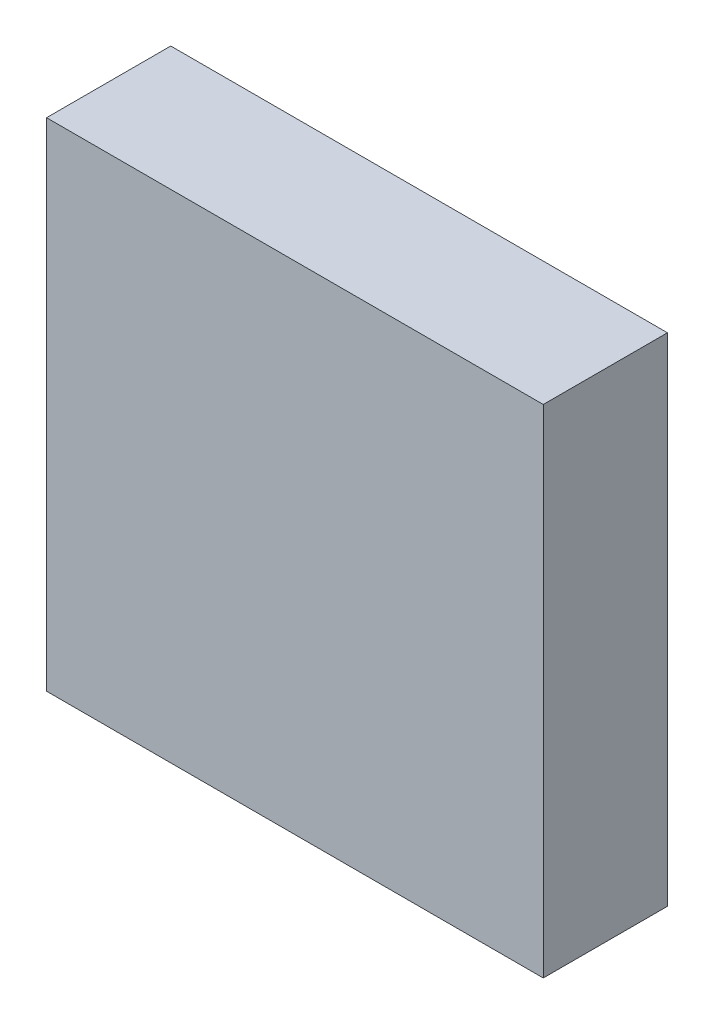
ISO-10303-21;
HEADER;
FILE_DESCRIPTION(('STEP AP214'),'2;1');
FILE_NAME('part.step','',(''),(''),'','','');
FILE_SCHEMA(('AUTOMOTIVE_DESIGN { 1 0 10303 214 1 1 1 1 }'));
ENDSEC;
DATA;
#1=APPLICATION_CONTEXT('core data for automotive mechanical design processes');
#2=APPLICATION_PROTOCOL_DEFINITION('international standard','automotive_design',2000,#1);
#3=PRODUCT_CONTEXT('',#1,'mechanical');
#4=PRODUCT('Part','Part','',(#3));
#5=PRODUCT_RELATED_PRODUCT_CATEGORY('part','',(#4));
#6=PRODUCT_DEFINITION_FORMATION('','',#4);
#7=PRODUCT_DEFINITION_CONTEXT('part definition',#1,'design');
#8=PRODUCT_DEFINITION('design','',#6,#7);
#9=PRODUCT_DEFINITION_SHAPE('','',#8);
#10=(LENGTH_UNIT() NAMED_UNIT(*) SI_UNIT(.MILLI.,.METRE.));
#11=(NAMED_UNIT(*) PLANE_ANGLE_UNIT() SI_UNIT($,.RADIAN.));
#12=(NAMED_UNIT(*) SI_UNIT($,.STERADIAN.) SOLID_ANGLE_UNIT());
#13=UNCERTAINTY_MEASURE_WITH_UNIT(LENGTH_MEASURE(1.E-05),#10,'distance_accuracy_value','');
#14=(GEOMETRIC_REPRESENTATION_CONTEXT(3) GLOBAL_UNCERTAINTY_ASSIGNED_CONTEXT((#13)) GLOBAL_UNIT_ASSIGNED_CONTEXT((#10,
#11,#12)) REPRESENTATION_CONTEXT('',''));
#15=CARTESIAN_POINT('',(0.,0.,0.));
#16=DIRECTION('',(0.,0.,1.));
#17=DIRECTION('',(1.,0.,0.));
#18=AXIS2_PLACEMENT_3D('',#15,#16,#17);
#19=CARTESIAN_POINT('',(0.,0.,30.));
#20=DIRECTION('',(1.,0.,0.));
#21=DIRECTION('',(0.,1.,0.));
#22=AXIS2_PLACEMENT_3D('',#19,#20,#21);
#23=PLANE('',#22);
#24=DIRECTION('',(0.,-1.,0.));
#25=VECTOR('',#24,1.);
#26=CARTESIAN_POINT('',(0.,0.,0.));
#27=LINE('',#26,#25);
#28=CARTESIAN_POINT('',(0.,120.,0.));
#29=VERTEX_POINT('',#28);
#30=CARTESIAN_POINT('',(0.,0.,0.));
#31=VERTEX_POINT('',#30);
#32=EDGE_CURVE('E96',#29,#31,#27,.T.);
#33=ORIENTED_EDGE('',*,*,#32,.T.);
#34=DIRECTION('',(0.,0.,-1.));
#35=VECTOR('',#34,1.);
#36=CARTESIAN_POINT('',(0.,0.,30.));
#37=LINE('',#36,#35);
#38=CARTESIAN_POINT('',(0.,0.,30.));
#39=VERTEX_POINT('',#38);
#40=EDGE_CURVE('E11',#39,#31,#37,.T.);
#41=ORIENTED_EDGE('',*,*,#40,.F.);
#42=DIRECTION('',(0.,-1.,0.));
#43=VECTOR('',#42,1.);
#44=CARTESIAN_POINT('',(0.,0.,30.));
#45=LINE('',#44,#43);
#46=CARTESIAN_POINT('',(0.,120.,30.));
#47=VERTEX_POINT('',#46);
#48=EDGE_CURVE('E84',#47,#39,#45,.T.);
#49=ORIENTED_EDGE('',*,*,#48,.F.);
#50=DIRECTION('',(0.,0.,-1.));
#51=VECTOR('',#50,1.);
#52=CARTESIAN_POINT('',(0.,120.,30.));
#53=LINE('',#52,#51);
#54=EDGE_CURVE('E92',#47,#29,#53,.T.);
#55=ORIENTED_EDGE('',*,*,#54,.T.);
#56=EDGE_LOOP('',(#33,#41,#49,#55));
#57=FACE_BOUND('',#56,.T.);
#58=ADVANCED_FACE('F33',(#57),#23,.F.);
#59=CARTESIAN_POINT('',(0.,0.,30.));
#60=DIRECTION('',(0.,1.,0.));
#61=DIRECTION('',(0.,0.,1.));
#62=AXIS2_PLACEMENT_3D('',#59,#60,#61);
#63=PLANE('',#62);
#64=DIRECTION('',(1.,0.,0.));
#65=VECTOR('',#64,1.);
#66=CARTESIAN_POINT('',(0.,0.,0.));
#67=LINE('',#66,#65);
#68=CARTESIAN_POINT('',(120.,0.,0.));
#69=VERTEX_POINT('',#68);
#70=EDGE_CURVE('E88',#31,#69,#67,.T.);
#71=ORIENTED_EDGE('',*,*,#70,.T.);
#72=DIRECTION('',(0.,0.,-1.));
#73=VECTOR('',#72,1.);
#74=CARTESIAN_POINT('',(120.,0.,30.));
#75=LINE('',#74,#73);
#76=CARTESIAN_POINT('',(120.,0.,30.));
#77=VERTEX_POINT('',#76);
#78=EDGE_CURVE('E41',#77,#69,#75,.T.);
#79=ORIENTED_EDGE('',*,*,#78,.F.);
#80=DIRECTION('',(1.,0.,0.));
#81=VECTOR('',#80,1.);
#82=CARTESIAN_POINT('',(0.,0.,30.));
#83=LINE('',#82,#81);
#84=EDGE_CURVE('E79',#39,#77,#83,.T.);
#85=ORIENTED_EDGE('',*,*,#84,.F.);
#86=ORIENTED_EDGE('',*,*,#40,.T.);
#87=EDGE_LOOP('',(#71,#79,#85,#86));
#88=FACE_BOUND('',#87,.T.);
#89=ADVANCED_FACE('F87',(#88),#63,.F.);
#90=CARTESIAN_POINT('',(120.,0.,30.));
#91=DIRECTION('',(-1.,0.,0.));
#92=DIRECTION('',(0.,-1.,0.));
#93=AXIS2_PLACEMENT_3D('',#90,#91,#92);
#94=PLANE('',#93);
#95=DIRECTION('',(0.,1.,0.));
#96=VECTOR('',#95,1.);
#97=CARTESIAN_POINT('',(120.,0.,0.));
#98=LINE('',#97,#96);
#99=CARTESIAN_POINT('',(120.,120.,0.));
#100=VERTEX_POINT('',#99);
#101=EDGE_CURVE('E66',#69,#100,#98,.T.);
#102=ORIENTED_EDGE('',*,*,#101,.T.);
#103=DIRECTION('',(0.,0.,-1.));
#104=VECTOR('',#103,1.);
#105=CARTESIAN_POINT('',(120.,120.,30.));
#106=LINE('',#105,#104);
#107=CARTESIAN_POINT('',(120.,120.,30.));
#108=VERTEX_POINT('',#107);
#109=EDGE_CURVE('E89',#108,#100,#106,.T.);
#110=ORIENTED_EDGE('',*,*,#109,.F.);
#111=DIRECTION('',(0.,1.,0.));
#112=VECTOR('',#111,1.);
#113=CARTESIAN_POINT('',(120.,0.,30.));
#114=LINE('',#113,#112);
#115=EDGE_CURVE('E82',#77,#108,#114,.T.);
#116=ORIENTED_EDGE('',*,*,#115,.F.);
#117=ORIENTED_EDGE('',*,*,#78,.T.);
#118=EDGE_LOOP('',(#102,#110,#116,#117));
#119=FACE_BOUND('',#118,.T.);
#120=ADVANCED_FACE('F90',(#119),#94,.F.);
#121=CARTESIAN_POINT('',(0.,120.,30.));
#122=DIRECTION('',(0.,-1.,0.));
#123=DIRECTION('',(0.,0.,-1.));
#124=AXIS2_PLACEMENT_3D('',#121,#122,#123);
#125=PLANE('',#124);
#126=DIRECTION('',(-1.,0.,0.));
#127=VECTOR('',#126,1.);
#128=CARTESIAN_POINT('',(0.,120.,0.));
#129=LINE('',#128,#127);
#130=EDGE_CURVE('E72',#100,#29,#129,.T.);
#131=ORIENTED_EDGE('',*,*,#130,.T.);
#132=ORIENTED_EDGE('',*,*,#54,.F.);
#133=DIRECTION('',(-1.,0.,0.));
#134=VECTOR('',#133,1.);
#135=CARTESIAN_POINT('',(0.,120.,30.));
#136=LINE('',#135,#134);
#137=EDGE_CURVE('E49',#108,#47,#136,.T.);
#138=ORIENTED_EDGE('',*,*,#137,.F.);
#139=ORIENTED_EDGE('',*,*,#109,.T.);
#140=EDGE_LOOP('',(#131,#132,#138,#139));
#141=FACE_BOUND('',#140,.T.);
#142=ADVANCED_FACE('F103',(#141),#125,.F.);
#143=CARTESIAN_POINT('',(0.,0.,30.));
#144=DIRECTION('',(0.,0.,-1.));
#145=DIRECTION('',(-1.,0.,0.));
#146=AXIS2_PLACEMENT_3D('',#143,#144,#145);
#147=PLANE('',#146);
#148=ORIENTED_EDGE('',*,*,#48,.T.);
#149=ORIENTED_EDGE('',*,*,#84,.T.);
#150=ORIENTED_EDGE('',*,*,#115,.T.);
#151=ORIENTED_EDGE('',*,*,#137,.T.);
#152=EDGE_LOOP('',(#148,#149,#150,#151));
#153=FACE_BOUND('',#152,.T.);
#154=ADVANCED_FACE('F80',(#153),#147,.F.);
#155=CARTESIAN_POINT('',(0.,0.,0.));
#156=DIRECTION('',(0.,0.,-1.));
#157=DIRECTION('',(-1.,0.,0.));
#158=AXIS2_PLACEMENT_3D('',#155,#156,#157);
#159=PLANE('',#158);
#160=ORIENTED_EDGE('',*,*,#32,.F.);
#161=ORIENTED_EDGE('',*,*,#130,.F.);
#162=ORIENTED_EDGE('',*,*,#101,.F.);
#163=ORIENTED_EDGE('',*,*,#70,.F.);
#164=EDGE_LOOP('',(#160,#161,#162,#163));
#165=FACE_BOUND('',#164,.T.);
#166=ADVANCED_FACE('F106',(#165),#159,.T.);
#167=CLOSED_SHELL('',(#58,#89,#120,#142,#154,#166));
#168=MANIFOLD_SOLID_BREP('B2',#167);
#169=ADVANCED_BREP_SHAPE_REPRESENTATION('',(#18,#168),#14);
#170=SHAPE_DEFINITION_REPRESENTATION(#9,#169);
ENDSEC;
END-ISO-10303-21;
